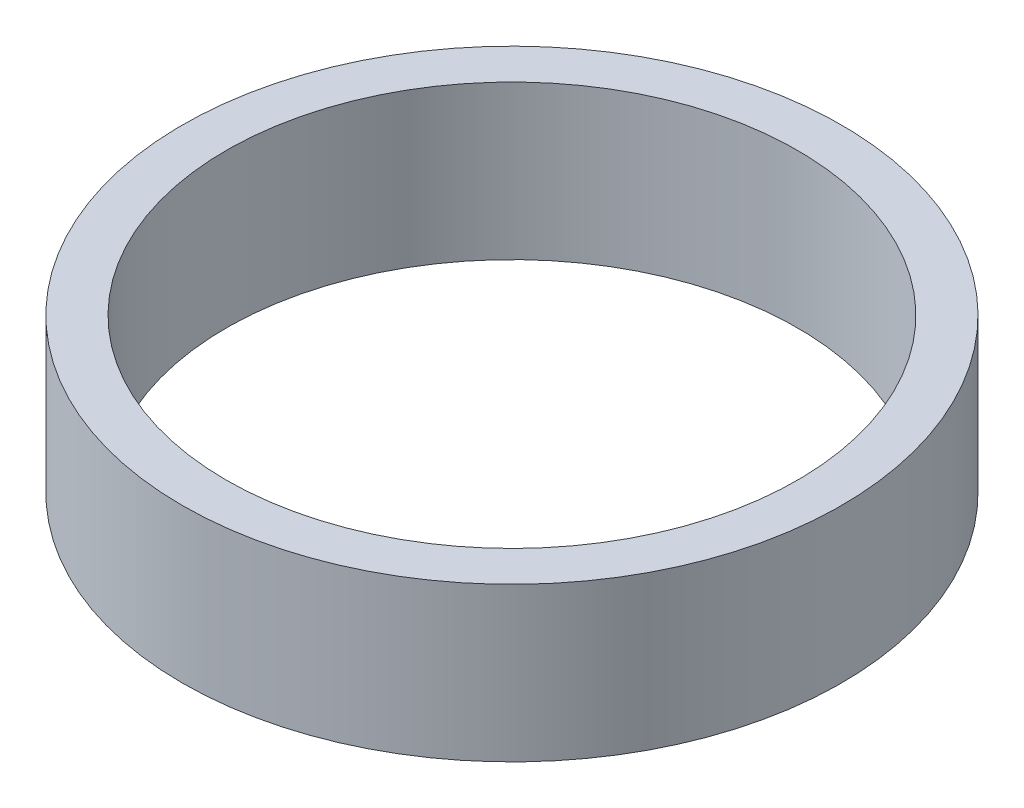
ISO-10303-21;
HEADER;
FILE_DESCRIPTION(('STEP AP214'),'2;1');
FILE_NAME('part.step','',(''),(''),'','','');
FILE_SCHEMA(('AUTOMOTIVE_DESIGN { 1 0 10303 214 1 1 1 1 }'));
ENDSEC;
DATA;
#1=APPLICATION_CONTEXT('core data for automotive mechanical design processes');
#2=APPLICATION_PROTOCOL_DEFINITION('international standard','automotive_design',2000,#1);
#3=PRODUCT_CONTEXT('',#1,'mechanical');
#4=PRODUCT('Part','Part','',(#3));
#5=PRODUCT_RELATED_PRODUCT_CATEGORY('part','',(#4));
#6=PRODUCT_DEFINITION_FORMATION('','',#4);
#7=PRODUCT_DEFINITION_CONTEXT('part definition',#1,'design');
#8=PRODUCT_DEFINITION('design','',#6,#7);
#9=PRODUCT_DEFINITION_SHAPE('','',#8);
#10=(LENGTH_UNIT() NAMED_UNIT(*) SI_UNIT(.MILLI.,.METRE.));
#11=(NAMED_UNIT(*) PLANE_ANGLE_UNIT() SI_UNIT($,.RADIAN.));
#12=(NAMED_UNIT(*) SI_UNIT($,.STERADIAN.) SOLID_ANGLE_UNIT());
#13=UNCERTAINTY_MEASURE_WITH_UNIT(LENGTH_MEASURE(1.E-05),#10,'distance_accuracy_value','');
#14=(GEOMETRIC_REPRESENTATION_CONTEXT(3) GLOBAL_UNCERTAINTY_ASSIGNED_CONTEXT((#13)) GLOBAL_UNIT_ASSIGNED_CONTEXT((#10,
#11,#12)) REPRESENTATION_CONTEXT('',''));
#15=CARTESIAN_POINT('',(0.,0.,0.));
#16=DIRECTION('',(0.,0.,1.));
#17=DIRECTION('',(1.,0.,0.));
#18=AXIS2_PLACEMENT_3D('',#15,#16,#17);
#19=CARTESIAN_POINT('',(0.,3.5,0.));
#20=DIRECTION('',(0.,1.,0.));
#21=DIRECTION('',(0.,0.,1.));
#22=AXIS2_PLACEMENT_3D('',#19,#20,#21);
#23=PLANE('',#22);
#24=CARTESIAN_POINT('',(0.,3.5,0.));
#25=DIRECTION('',(0.,1.,0.));
#26=DIRECTION('',(0.,0.,1.));
#27=AXIS2_PLACEMENT_3D('',#24,#25,#26);
#28=CIRCLE('',#27,7.5);
#29=CARTESIAN_POINT('',(0.,3.5,7.5));
#30=VERTEX_POINT('',#29);
#31=EDGE_CURVE('E11',#30,#30,#28,.T.);
#32=ORIENTED_EDGE('',*,*,#31,.T.);
#33=EDGE_LOOP('',(#32));
#34=FACE_BOUND('',#33,.T.);
#35=CARTESIAN_POINT('',(0.,3.5,0.));
#36=DIRECTION('',(0.,1.,0.));
#37=DIRECTION('',(0.,0.,1.));
#38=AXIS2_PLACEMENT_3D('',#35,#36,#37);
#39=CIRCLE('',#38,6.5);
#40=CARTESIAN_POINT('',(0.,3.5,6.5));
#41=VERTEX_POINT('',#40);
#42=EDGE_CURVE('E47',#41,#41,#39,.T.);
#43=ORIENTED_EDGE('',*,*,#42,.F.);
#44=EDGE_LOOP('',(#43));
#45=FACE_BOUND('',#44,.T.);
#46=ADVANCED_FACE('F36',(#34,#45),#23,.T.);
#47=CARTESIAN_POINT('',(0.,0.,0.));
#48=DIRECTION('',(0.,1.,0.));
#49=DIRECTION('',(0.,0.,1.));
#50=AXIS2_PLACEMENT_3D('',#47,#48,#49);
#51=PLANE('',#50);
#52=CARTESIAN_POINT('',(0.,0.,0.));
#53=DIRECTION('',(0.,1.,0.));
#54=DIRECTION('',(0.,0.,1.));
#55=AXIS2_PLACEMENT_3D('',#52,#53,#54);
#56=CIRCLE('',#55,7.5);
#57=CARTESIAN_POINT('',(0.,0.,7.5));
#58=VERTEX_POINT('',#57);
#59=EDGE_CURVE('E40',#58,#58,#56,.T.);
#60=ORIENTED_EDGE('',*,*,#59,.F.);
#61=EDGE_LOOP('',(#60));
#62=FACE_BOUND('',#61,.T.);
#63=CARTESIAN_POINT('',(0.,0.,0.));
#64=DIRECTION('',(0.,1.,0.));
#65=DIRECTION('',(0.,0.,1.));
#66=AXIS2_PLACEMENT_3D('',#63,#64,#65);
#67=CIRCLE('',#66,6.5);
#68=CARTESIAN_POINT('',(0.,0.,6.5));
#69=VERTEX_POINT('',#68);
#70=EDGE_CURVE('E49',#69,#69,#67,.T.);
#71=ORIENTED_EDGE('',*,*,#70,.T.);
#72=EDGE_LOOP('',(#71));
#73=FACE_BOUND('',#72,.T.);
#74=ADVANCED_FACE('F59',(#62,#73),#51,.F.);
#75=CARTESIAN_POINT('',(0.,3.5,0.));
#76=DIRECTION('',(0.,-1.,0.));
#77=DIRECTION('',(0.,0.,-1.));
#78=AXIS2_PLACEMENT_3D('',#75,#76,#77);
#79=CYLINDRICAL_SURFACE('',#78,7.5);
#80=ORIENTED_EDGE('',*,*,#31,.F.);
#81=EDGE_LOOP('',(#80));
#82=FACE_BOUND('',#81,.T.);
#83=ORIENTED_EDGE('',*,*,#59,.T.);
#84=EDGE_LOOP('',(#83));
#85=FACE_BOUND('',#84,.T.);
#86=ADVANCED_FACE('F38',(#82,#85),#79,.T.);
#87=CARTESIAN_POINT('',(0.,3.5,0.));
#88=DIRECTION('',(0.,-1.,0.));
#89=DIRECTION('',(0.,0.,-1.));
#90=AXIS2_PLACEMENT_3D('',#87,#88,#89);
#91=CYLINDRICAL_SURFACE('',#90,6.5);
#92=ORIENTED_EDGE('',*,*,#42,.T.);
#93=EDGE_LOOP('',(#92));
#94=FACE_BOUND('',#93,.T.);
#95=ORIENTED_EDGE('',*,*,#70,.F.);
#96=EDGE_LOOP('',(#95));
#97=FACE_BOUND('',#96,.T.);
#98=ADVANCED_FACE('F55',(#94,#97),#91,.F.);
#99=CLOSED_SHELL('',(#46,#74,#86,#98));
#100=MANIFOLD_SOLID_BREP('B2',#99);
#101=ADVANCED_BREP_SHAPE_REPRESENTATION('',(#18,#100),#14);
#102=SHAPE_DEFINITION_REPRESENTATION(#9,#101);
ENDSEC;
END-ISO-10303-21;
